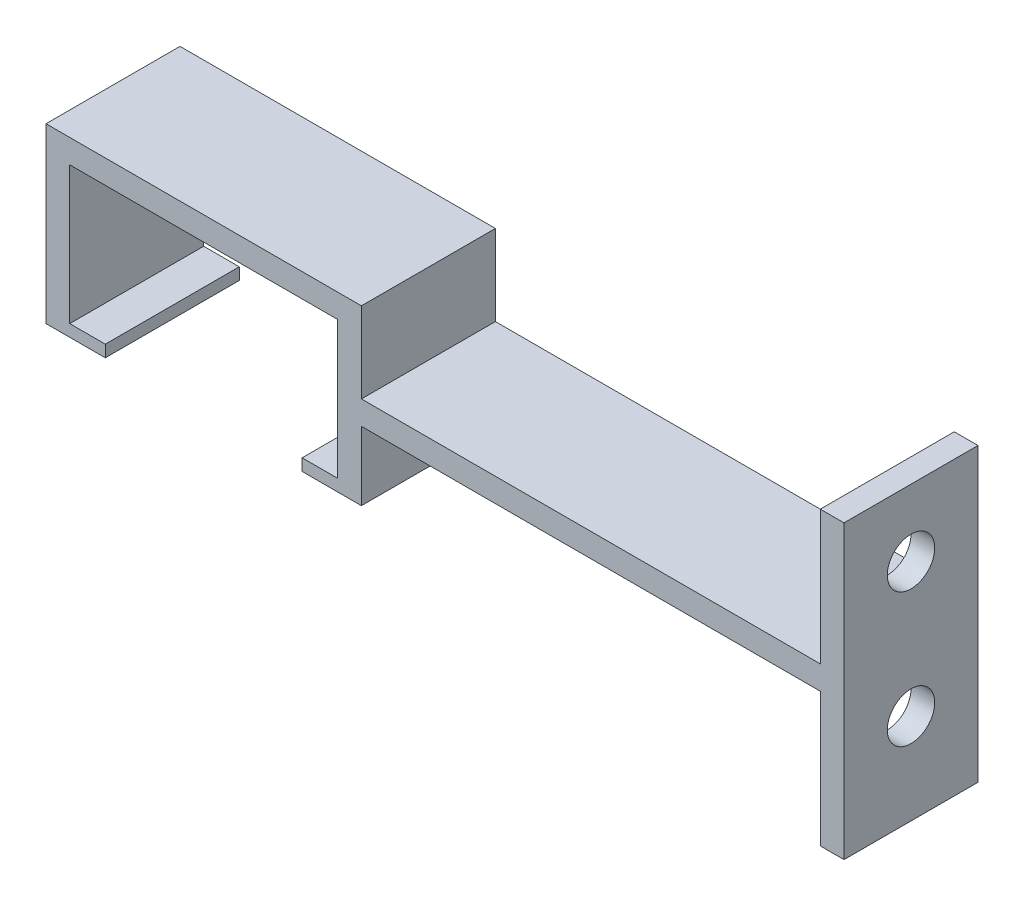
ISO-10303-21;
HEADER;
FILE_DESCRIPTION(('STEP AP214'),'2;1');
FILE_NAME('part.step','',(''),(''),'','','');
FILE_SCHEMA(('AUTOMOTIVE_DESIGN { 1 0 10303 214 1 1 1 1 }'));
ENDSEC;
DATA;
#1=APPLICATION_CONTEXT('core data for automotive mechanical design processes');
#2=APPLICATION_PROTOCOL_DEFINITION('international standard','automotive_design',2000,#1);
#3=PRODUCT_CONTEXT('',#1,'mechanical');
#4=PRODUCT('Part','Part','',(#3));
#5=PRODUCT_RELATED_PRODUCT_CATEGORY('part','',(#4));
#6=PRODUCT_DEFINITION_FORMATION('','',#4);
#7=PRODUCT_DEFINITION_CONTEXT('part definition',#1,'design');
#8=PRODUCT_DEFINITION('design','',#6,#7);
#9=PRODUCT_DEFINITION_SHAPE('','',#8);
#10=(LENGTH_UNIT() NAMED_UNIT(*) SI_UNIT(.MILLI.,.METRE.));
#11=(NAMED_UNIT(*) PLANE_ANGLE_UNIT() SI_UNIT($,.RADIAN.));
#12=(NAMED_UNIT(*) SI_UNIT($,.STERADIAN.) SOLID_ANGLE_UNIT());
#13=UNCERTAINTY_MEASURE_WITH_UNIT(LENGTH_MEASURE(1.E-05),#10,'distance_accuracy_value','');
#14=(GEOMETRIC_REPRESENTATION_CONTEXT(3) GLOBAL_UNCERTAINTY_ASSIGNED_CONTEXT((#13)) GLOBAL_UNIT_ASSIGNED_CONTEXT((#10,
#11,#12)) REPRESENTATION_CONTEXT('',''));
#15=CARTESIAN_POINT('',(0.,0.,0.));
#16=DIRECTION('',(0.,0.,1.));
#17=DIRECTION('',(1.,0.,0.));
#18=AXIS2_PLACEMENT_3D('',#15,#16,#17);
#19=CARTESIAN_POINT('',(0.,5.8,0.));
#20=DIRECTION('',(0.,1.,0.));
#21=DIRECTION('',(0.,0.,1.));
#22=AXIS2_PLACEMENT_3D('',#19,#20,#21);
#23=PLANE('',#22);
#24=DIRECTION('',(0.,0.,1.));
#25=VECTOR('',#24,1.);
#26=CARTESIAN_POINT('',(1.,5.8,11.3));
#27=LINE('',#26,#25);
#28=CARTESIAN_POINT('',(1.,5.8,0.));
#29=VERTEX_POINT('',#28);
#30=CARTESIAN_POINT('',(1.,5.8,11.3));
#31=VERTEX_POINT('',#30);
#32=EDGE_CURVE('E220',#29,#31,#27,.T.);
#33=ORIENTED_EDGE('',*,*,#32,.F.);
#34=DIRECTION('',(1.,0.,0.));
#35=VECTOR('',#34,1.);
#36=CARTESIAN_POINT('',(2.,5.8,0.));
#37=LINE('',#36,#35);
#38=CARTESIAN_POINT('',(39.7,5.8,0.));
#39=VERTEX_POINT('',#38);
#40=EDGE_CURVE('E307',#29,#39,#37,.T.);
#41=ORIENTED_EDGE('',*,*,#40,.T.);
#42=DIRECTION('',(0.,0.,-1.));
#43=VECTOR('',#42,1.);
#44=CARTESIAN_POINT('',(39.7,5.8,0.));
#45=LINE('',#44,#43);
#46=CARTESIAN_POINT('',(39.7,5.8,11.3));
#47=VERTEX_POINT('',#46);
#48=EDGE_CURVE('E273',#47,#39,#45,.T.);
#49=ORIENTED_EDGE('',*,*,#48,.F.);
#50=DIRECTION('',(-1.,0.,0.));
#51=VECTOR('',#50,1.);
#52=CARTESIAN_POINT('',(2.,5.8,11.3));
#53=LINE('',#52,#51);
#54=EDGE_CURVE('E67',#47,#31,#53,.T.);
#55=ORIENTED_EDGE('',*,*,#54,.T.);
#56=EDGE_LOOP('',(#33,#41,#49,#55));
#57=FACE_BOUND('',#56,.T.);
#58=ADVANCED_FACE('F41',(#57),#23,.F.);
#59=CARTESIAN_POINT('',(41.7,7.8,11.3));
#60=DIRECTION('',(0.,-1.,0.));
#61=DIRECTION('',(0.,0.,-1.));
#62=AXIS2_PLACEMENT_3D('',#59,#60,#61);
#63=PLANE('',#62);
#64=DIRECTION('',(0.,0.,1.));
#65=VECTOR('',#64,1.);
#66=CARTESIAN_POINT('',(39.7,7.8,11.3));
#67=LINE('',#66,#65);
#68=CARTESIAN_POINT('',(39.7,7.8,0.));
#69=VERTEX_POINT('',#68);
#70=CARTESIAN_POINT('',(39.7,7.8,11.3));
#71=VERTEX_POINT('',#70);
#72=EDGE_CURVE('E248',#69,#71,#67,.T.);
#73=ORIENTED_EDGE('',*,*,#72,.F.);
#74=DIRECTION('',(-1.,0.,0.));
#75=VECTOR('',#74,1.);
#76=CARTESIAN_POINT('',(41.7,7.8,0.));
#77=LINE('',#76,#75);
#78=CARTESIAN_POINT('',(1.,7.8,0.));
#79=VERTEX_POINT('',#78);
#80=EDGE_CURVE('E197',#69,#79,#77,.T.);
#81=ORIENTED_EDGE('',*,*,#80,.T.);
#82=DIRECTION('',(0.,0.,-1.));
#83=VECTOR('',#82,1.);
#84=CARTESIAN_POINT('',(1.,7.8,0.));
#85=LINE('',#84,#83);
#86=CARTESIAN_POINT('',(1.,7.8,11.3));
#87=VERTEX_POINT('',#86);
#88=EDGE_CURVE('E200',#87,#79,#85,.T.);
#89=ORIENTED_EDGE('',*,*,#88,.F.);
#90=DIRECTION('',(-1.,0.,0.));
#91=VECTOR('',#90,1.);
#92=CARTESIAN_POINT('',(41.7,7.8,11.3));
#93=LINE('',#92,#91);
#94=EDGE_CURVE('E185',#71,#87,#93,.T.);
#95=ORIENTED_EDGE('',*,*,#94,.F.);
#96=EDGE_LOOP('',(#73,#81,#89,#95));
#97=FACE_BOUND('',#96,.T.);
#98=ADVANCED_FACE('F201',(#97),#63,.F.);
#99=CARTESIAN_POINT('',(-20.6,0.,11.3));
#100=DIRECTION('',(0.,1.,0.));
#101=DIRECTION('',(-1.,0.,0.));
#102=AXIS2_PLACEMENT_3D('',#99,#100,#101);
#103=PLANE('',#102);
#104=DIRECTION('',(1.,0.,0.));
#105=VECTOR('',#104,1.);
#106=CARTESIAN_POINT('',(-20.6,0.,0.));
#107=LINE('',#106,#105);
#108=CARTESIAN_POINT('',(-25.6,0.,0.));
#109=VERTEX_POINT('',#108);
#110=CARTESIAN_POINT('',(-20.6,0.,0.));
#111=VERTEX_POINT('',#110);
#112=EDGE_CURVE('E316',#109,#111,#107,.T.);
#113=ORIENTED_EDGE('',*,*,#112,.T.);
#114=DIRECTION('',(0.,0.,-1.));
#115=VECTOR('',#114,1.);
#116=CARTESIAN_POINT('',(-20.6,0.,11.3));
#117=LINE('',#116,#115);
#118=CARTESIAN_POINT('',(-20.6,0.,11.3));
#119=VERTEX_POINT('',#118);
#120=EDGE_CURVE('E11',#119,#111,#117,.T.);
#121=ORIENTED_EDGE('',*,*,#120,.F.);
#122=DIRECTION('',(1.,0.,0.));
#123=VECTOR('',#122,1.);
#124=CARTESIAN_POINT('',(-20.6,0.,11.3));
#125=LINE('',#124,#123);
#126=CARTESIAN_POINT('',(-25.6,0.,11.3));
#127=VERTEX_POINT('',#126);
#128=EDGE_CURVE('E317',#127,#119,#125,.T.);
#129=ORIENTED_EDGE('',*,*,#128,.F.);
#130=DIRECTION('',(0.,0.,1.));
#131=VECTOR('',#130,1.);
#132=CARTESIAN_POINT('',(-25.6,0.,0.));
#133=LINE('',#132,#131);
#134=EDGE_CURVE('E244',#109,#127,#133,.T.);
#135=ORIENTED_EDGE('',*,*,#134,.F.);
#136=EDGE_LOOP('',(#113,#121,#129,#135));
#137=FACE_BOUND('',#136,.T.);
#138=ADVANCED_FACE('F43',(#137),#103,.F.);
#139=CARTESIAN_POINT('',(-20.6,0.999999999999997,11.3));
#140=DIRECTION('',(-1.,0.,0.));
#141=DIRECTION('',(0.,0.,1.));
#142=AXIS2_PLACEMENT_3D('',#139,#140,#141);
#143=PLANE('',#142);
#144=DIRECTION('',(0.,1.,0.));
#145=VECTOR('',#144,1.);
#146=CARTESIAN_POINT('',(-20.6,0.999999999999997,0.));
#147=LINE('',#146,#145);
#148=CARTESIAN_POINT('',(-20.6,0.999999999999997,0.));
#149=VERTEX_POINT('',#148);
#150=EDGE_CURVE('E348',#111,#149,#147,.T.);
#151=ORIENTED_EDGE('',*,*,#150,.T.);
#152=DIRECTION('',(0.,0.,-1.));
#153=VECTOR('',#152,1.);
#154=CARTESIAN_POINT('',(-20.6,0.999999999999997,11.3));
#155=LINE('',#154,#153);
#156=CARTESIAN_POINT('',(-20.6,0.999999999999997,11.3));
#157=VERTEX_POINT('',#156);
#158=EDGE_CURVE('E51',#157,#149,#155,.T.);
#159=ORIENTED_EDGE('',*,*,#158,.F.);
#160=DIRECTION('',(0.,1.,0.));
#161=VECTOR('',#160,1.);
#162=CARTESIAN_POINT('',(-20.6,0.999999999999997,11.3));
#163=LINE('',#162,#161);
#164=EDGE_CURVE('E320',#119,#157,#163,.T.);
#165=ORIENTED_EDGE('',*,*,#164,.F.);
#166=ORIENTED_EDGE('',*,*,#120,.T.);
#167=EDGE_LOOP('',(#151,#159,#165,#166));
#168=FACE_BOUND('',#167,.T.);
#169=ADVANCED_FACE('F451',(#168),#143,.F.);
#170=CARTESIAN_POINT('',(-23.6,0.999999999999997,11.3));
#171=DIRECTION('',(0.,-1.,0.));
#172=DIRECTION('',(1.,0.,0.));
#173=AXIS2_PLACEMENT_3D('',#170,#171,#172);
#174=PLANE('',#173);
#175=DIRECTION('',(-1.,0.,0.));
#176=VECTOR('',#175,1.);
#177=CARTESIAN_POINT('',(-23.6,0.999999999999997,0.));
#178=LINE('',#177,#176);
#179=CARTESIAN_POINT('',(-23.6,0.999999999999997,0.));
#180=VERTEX_POINT('',#179);
#181=EDGE_CURVE('E351',#149,#180,#178,.T.);
#182=ORIENTED_EDGE('',*,*,#181,.T.);
#183=DIRECTION('',(0.,0.,-1.));
#184=VECTOR('',#183,1.);
#185=CARTESIAN_POINT('',(-23.6,0.999999999999997,11.3));
#186=LINE('',#185,#184);
#187=CARTESIAN_POINT('',(-23.6,0.999999999999997,11.3));
#188=VERTEX_POINT('',#187);
#189=EDGE_CURVE('E390',#188,#180,#186,.T.);
#190=ORIENTED_EDGE('',*,*,#189,.F.);
#191=DIRECTION('',(-1.,0.,0.));
#192=VECTOR('',#191,1.);
#193=CARTESIAN_POINT('',(-23.6,0.999999999999997,11.3));
#194=LINE('',#193,#192);
#195=EDGE_CURVE('E324',#157,#188,#194,.T.);
#196=ORIENTED_EDGE('',*,*,#195,.F.);
#197=ORIENTED_EDGE('',*,*,#158,.T.);
#198=EDGE_LOOP('',(#182,#190,#196,#197));
#199=FACE_BOUND('',#198,.T.);
#200=ADVANCED_FACE('F456',(#199),#174,.F.);
#201=CARTESIAN_POINT('',(-23.6,12.6,11.3));
#202=DIRECTION('',(-1.,0.,0.));
#203=DIRECTION('',(0.,0.,1.));
#204=AXIS2_PLACEMENT_3D('',#201,#202,#203);
#205=PLANE('',#204);
#206=DIRECTION('',(0.,1.,0.));
#207=VECTOR('',#206,1.);
#208=CARTESIAN_POINT('',(-23.6,12.6,0.));
#209=LINE('',#208,#207);
#210=CARTESIAN_POINT('',(-23.6,12.6,0.));
#211=VERTEX_POINT('',#210);
#212=EDGE_CURVE('E354',#180,#211,#209,.T.);
#213=ORIENTED_EDGE('',*,*,#212,.T.);
#214=DIRECTION('',(0.,0.,-1.));
#215=VECTOR('',#214,1.);
#216=CARTESIAN_POINT('',(-23.6,12.6,11.3));
#217=LINE('',#216,#215);
#218=CARTESIAN_POINT('',(-23.6,12.6,11.3));
#219=VERTEX_POINT('',#218);
#220=EDGE_CURVE('E386',#219,#211,#217,.T.);
#221=ORIENTED_EDGE('',*,*,#220,.F.);
#222=DIRECTION('',(0.,1.,0.));
#223=VECTOR('',#222,1.);
#224=CARTESIAN_POINT('',(-23.6,12.6,11.3));
#225=LINE('',#224,#223);
#226=EDGE_CURVE('E327',#188,#219,#225,.T.);
#227=ORIENTED_EDGE('',*,*,#226,.F.);
#228=ORIENTED_EDGE('',*,*,#189,.T.);
#229=EDGE_LOOP('',(#213,#221,#227,#228));
#230=FACE_BOUND('',#229,.T.);
#231=ADVANCED_FACE('F462',(#230),#205,.F.);
#232=CARTESIAN_POINT('',(-23.6,12.6,11.3));
#233=DIRECTION('',(0.,1.,0.));
#234=DIRECTION('',(0.,0.,1.));
#235=AXIS2_PLACEMENT_3D('',#232,#233,#234);
#236=PLANE('',#235);
#237=DIRECTION('',(1.,0.,0.));
#238=VECTOR('',#237,1.);
#239=CARTESIAN_POINT('',(-23.6,12.6,0.));
#240=LINE('',#239,#238);
#241=CARTESIAN_POINT('',(-1.,12.6,0.));
#242=VERTEX_POINT('',#241);
#243=EDGE_CURVE('E357',#211,#242,#240,.T.);
#244=ORIENTED_EDGE('',*,*,#243,.T.);
#245=DIRECTION('',(0.,0.,-1.));
#246=VECTOR('',#245,1.);
#247=CARTESIAN_POINT('',(-1.,12.6,11.3));
#248=LINE('',#247,#246);
#249=CARTESIAN_POINT('',(-1.,12.6,11.3));
#250=VERTEX_POINT('',#249);
#251=EDGE_CURVE('E382',#250,#242,#248,.T.);
#252=ORIENTED_EDGE('',*,*,#251,.F.);
#253=DIRECTION('',(1.,0.,0.));
#254=VECTOR('',#253,1.);
#255=CARTESIAN_POINT('',(-23.6,12.6,11.3));
#256=LINE('',#255,#254);
#257=EDGE_CURVE('E330',#219,#250,#256,.T.);
#258=ORIENTED_EDGE('',*,*,#257,.F.);
#259=ORIENTED_EDGE('',*,*,#220,.T.);
#260=EDGE_LOOP('',(#244,#252,#258,#259));
#261=FACE_BOUND('',#260,.T.);
#262=ADVANCED_FACE('F466',(#261),#236,.F.);
#263=CARTESIAN_POINT('',(-1.,12.6,11.3));
#264=DIRECTION('',(1.,0.,0.));
#265=DIRECTION('',(0.,0.,-1.));
#266=AXIS2_PLACEMENT_3D('',#263,#264,#265);
#267=PLANE('',#266);
#268=DIRECTION('',(0.,-1.,0.));
#269=VECTOR('',#268,1.);
#270=CARTESIAN_POINT('',(-1.,12.6,0.));
#271=LINE('',#270,#269);
#272=CARTESIAN_POINT('',(-1.,0.999999999999997,0.));
#273=VERTEX_POINT('',#272);
#274=EDGE_CURVE('E360',#242,#273,#271,.T.);
#275=ORIENTED_EDGE('',*,*,#274,.T.);
#276=DIRECTION('',(0.,0.,-1.));
#277=VECTOR('',#276,1.);
#278=CARTESIAN_POINT('',(-1.,0.999999999999997,11.3));
#279=LINE('',#278,#277);
#280=CARTESIAN_POINT('',(-1.,0.999999999999997,11.3));
#281=VERTEX_POINT('',#280);
#282=EDGE_CURVE('E378',#281,#273,#279,.T.);
#283=ORIENTED_EDGE('',*,*,#282,.F.);
#284=DIRECTION('',(0.,-1.,0.));
#285=VECTOR('',#284,1.);
#286=CARTESIAN_POINT('',(-1.,12.6,11.3));
#287=LINE('',#286,#285);
#288=EDGE_CURVE('E333',#250,#281,#287,.T.);
#289=ORIENTED_EDGE('',*,*,#288,.F.);
#290=ORIENTED_EDGE('',*,*,#251,.T.);
#291=EDGE_LOOP('',(#275,#283,#289,#290));
#292=FACE_BOUND('',#291,.T.);
#293=ADVANCED_FACE('F471',(#292),#267,.F.);
#294=CARTESIAN_POINT('',(-4.,0.999999999999997,11.3));
#295=DIRECTION('',(0.,-1.,0.));
#296=DIRECTION('',(1.,0.,0.));
#297=AXIS2_PLACEMENT_3D('',#294,#295,#296);
#298=PLANE('',#297);
#299=DIRECTION('',(-1.,0.,0.));
#300=VECTOR('',#299,1.);
#301=CARTESIAN_POINT('',(-4.,0.999999999999997,0.));
#302=LINE('',#301,#300);
#303=CARTESIAN_POINT('',(-4.,0.999999999999997,0.));
#304=VERTEX_POINT('',#303);
#305=EDGE_CURVE('E363',#273,#304,#302,.T.);
#306=ORIENTED_EDGE('',*,*,#305,.T.);
#307=DIRECTION('',(0.,0.,-1.));
#308=VECTOR('',#307,1.);
#309=CARTESIAN_POINT('',(-4.,0.999999999999997,11.3));
#310=LINE('',#309,#308);
#311=CARTESIAN_POINT('',(-4.,0.999999999999997,11.3));
#312=VERTEX_POINT('',#311);
#313=EDGE_CURVE('E374',#312,#304,#310,.T.);
#314=ORIENTED_EDGE('',*,*,#313,.F.);
#315=DIRECTION('',(-1.,0.,0.));
#316=VECTOR('',#315,1.);
#317=CARTESIAN_POINT('',(-4.,0.999999999999997,11.3));
#318=LINE('',#317,#316);
#319=EDGE_CURVE('E336',#281,#312,#318,.T.);
#320=ORIENTED_EDGE('',*,*,#319,.F.);
#321=ORIENTED_EDGE('',*,*,#282,.T.);
#322=EDGE_LOOP('',(#306,#314,#320,#321));
#323=FACE_BOUND('',#322,.T.);
#324=ADVANCED_FACE('F477',(#323),#298,.F.);
#325=CARTESIAN_POINT('',(-4.,0.999999999999997,11.3));
#326=DIRECTION('',(1.,0.,0.));
#327=DIRECTION('',(0.,0.,-1.));
#328=AXIS2_PLACEMENT_3D('',#325,#326,#327);
#329=PLANE('',#328);
#330=DIRECTION('',(0.,-1.,0.));
#331=VECTOR('',#330,1.);
#332=CARTESIAN_POINT('',(-4.,0.999999999999997,0.));
#333=LINE('',#332,#331);
#334=CARTESIAN_POINT('',(-4.,0.,0.));
#335=VERTEX_POINT('',#334);
#336=EDGE_CURVE('E366',#304,#335,#333,.T.);
#337=ORIENTED_EDGE('',*,*,#336,.T.);
#338=DIRECTION('',(0.,0.,-1.));
#339=VECTOR('',#338,1.);
#340=CARTESIAN_POINT('',(-4.,0.,11.3));
#341=LINE('',#340,#339);
#342=CARTESIAN_POINT('',(-4.,0.,11.3));
#343=VERTEX_POINT('',#342);
#344=EDGE_CURVE('E345',#343,#335,#341,.T.);
#345=ORIENTED_EDGE('',*,*,#344,.F.);
#346=DIRECTION('',(0.,-1.,0.));
#347=VECTOR('',#346,1.);
#348=CARTESIAN_POINT('',(-4.,0.999999999999997,11.3));
#349=LINE('',#348,#347);
#350=EDGE_CURVE('E339',#312,#343,#349,.T.);
#351=ORIENTED_EDGE('',*,*,#350,.F.);
#352=ORIENTED_EDGE('',*,*,#313,.T.);
#353=EDGE_LOOP('',(#337,#345,#351,#352));
#354=FACE_BOUND('',#353,.T.);
#355=ADVANCED_FACE('F481',(#354),#329,.F.);
#356=CARTESIAN_POINT('',(0.,0.,11.3));
#357=DIRECTION('',(0.,1.,0.));
#358=DIRECTION('',(-1.,0.,0.));
#359=AXIS2_PLACEMENT_3D('',#356,#357,#358);
#360=PLANE('',#359);
#361=DIRECTION('',(1.,0.,0.));
#362=VECTOR('',#361,1.);
#363=CARTESIAN_POINT('',(0.,0.,0.));
#364=LINE('',#363,#362);
#365=CARTESIAN_POINT('',(1.,0.,0.));
#366=VERTEX_POINT('',#365);
#367=EDGE_CURVE('E321',#335,#366,#364,.T.);
#368=ORIENTED_EDGE('',*,*,#367,.T.);
#369=DIRECTION('',(0.,0.,1.));
#370=VECTOR('',#369,1.);
#371=CARTESIAN_POINT('',(1.,0.,11.3));
#372=LINE('',#371,#370);
#373=CARTESIAN_POINT('',(1.,0.,11.3));
#374=VERTEX_POINT('',#373);
#375=EDGE_CURVE('E221',#366,#374,#372,.T.);
#376=ORIENTED_EDGE('',*,*,#375,.T.);
#377=DIRECTION('',(1.,0.,0.));
#378=VECTOR('',#377,1.);
#379=CARTESIAN_POINT('',(0.,0.,11.3));
#380=LINE('',#379,#378);
#381=EDGE_CURVE('E342',#343,#374,#380,.T.);
#382=ORIENTED_EDGE('',*,*,#381,.F.);
#383=ORIENTED_EDGE('',*,*,#344,.T.);
#384=EDGE_LOOP('',(#368,#376,#382,#383));
#385=FACE_BOUND('',#384,.T.);
#386=ADVANCED_FACE('F485',(#385),#360,.F.);
#387=CARTESIAN_POINT('',(0.,0.,11.3));
#388=DIRECTION('',(0.,0.,1.));
#389=DIRECTION('',(1.,0.,0.));
#390=AXIS2_PLACEMENT_3D('',#387,#388,#389);
#391=PLANE('',#390);
#392=ORIENTED_EDGE('',*,*,#94,.T.);
#393=DIRECTION('',(0.,-1.,0.));
#394=VECTOR('',#393,1.);
#395=CARTESIAN_POINT('',(1.,7.8,11.3));
#396=LINE('',#395,#394);
#397=CARTESIAN_POINT('',(1.,14.6,11.3));
#398=VERTEX_POINT('',#397);
#399=EDGE_CURVE('E189',#398,#87,#396,.T.);
#400=ORIENTED_EDGE('',*,*,#399,.F.);
#401=DIRECTION('',(1.,0.,0.));
#402=VECTOR('',#401,1.);
#403=CARTESIAN_POINT('',(-16.6,14.6,11.3));
#404=LINE('',#403,#402);
#405=CARTESIAN_POINT('',(-25.6,14.6,11.3));
#406=VERTEX_POINT('',#405);
#407=EDGE_CURVE('E310',#406,#398,#404,.T.);
#408=ORIENTED_EDGE('',*,*,#407,.F.);
#409=DIRECTION('',(0.,-1.,0.));
#410=VECTOR('',#409,1.);
#411=CARTESIAN_POINT('',(-25.6,14.6,11.3));
#412=LINE('',#411,#410);
#413=EDGE_CURVE('E235',#406,#127,#412,.T.);
#414=ORIENTED_EDGE('',*,*,#413,.T.);
#415=ORIENTED_EDGE('',*,*,#128,.T.);
#416=ORIENTED_EDGE('',*,*,#164,.T.);
#417=ORIENTED_EDGE('',*,*,#195,.T.);
#418=ORIENTED_EDGE('',*,*,#226,.T.);
#419=ORIENTED_EDGE('',*,*,#257,.T.);
#420=ORIENTED_EDGE('',*,*,#288,.T.);
#421=ORIENTED_EDGE('',*,*,#319,.T.);
#422=ORIENTED_EDGE('',*,*,#350,.T.);
#423=ORIENTED_EDGE('',*,*,#381,.T.);
#424=DIRECTION('',(0.,1.,0.));
#425=VECTOR('',#424,1.);
#426=CARTESIAN_POINT('',(1.,0.,11.3));
#427=LINE('',#426,#425);
#428=EDGE_CURVE('E225',#374,#31,#427,.T.);
#429=ORIENTED_EDGE('',*,*,#428,.T.);
#430=ORIENTED_EDGE('',*,*,#54,.F.);
#431=DIRECTION('',(0.,1.,0.));
#432=VECTOR('',#431,1.);
#433=CARTESIAN_POINT('',(39.7,-5.5,11.3));
#434=LINE('',#433,#432);
#435=CARTESIAN_POINT('',(39.7,-5.5,11.3));
#436=VERTEX_POINT('',#435);
#437=EDGE_CURVE('E295',#436,#47,#434,.T.);
#438=ORIENTED_EDGE('',*,*,#437,.F.);
#439=DIRECTION('',(-1.,0.,0.));
#440=VECTOR('',#439,1.);
#441=CARTESIAN_POINT('',(41.7,-5.5,11.3));
#442=LINE('',#441,#440);
#443=CARTESIAN_POINT('',(41.7,-5.5,11.3));
#444=VERTEX_POINT('',#443);
#445=EDGE_CURVE('E278',#444,#436,#442,.T.);
#446=ORIENTED_EDGE('',*,*,#445,.F.);
#447=DIRECTION('',(0.,-1.,0.));
#448=VECTOR('',#447,1.);
#449=CARTESIAN_POINT('',(41.7,5.8,11.3));
#450=LINE('',#449,#448);
#451=CARTESIAN_POINT('',(41.7,19.1,11.3));
#452=VERTEX_POINT('',#451);
#453=EDGE_CURVE('E298',#452,#444,#450,.T.);
#454=ORIENTED_EDGE('',*,*,#453,.F.);
#455=DIRECTION('',(1.,0.,0.));
#456=VECTOR('',#455,1.);
#457=CARTESIAN_POINT('',(41.7,19.1,11.3));
#458=LINE('',#457,#456);
#459=CARTESIAN_POINT('',(39.7,19.1,11.3));
#460=VERTEX_POINT('',#459);
#461=EDGE_CURVE('E262',#460,#452,#458,.T.);
#462=ORIENTED_EDGE('',*,*,#461,.F.);
#463=DIRECTION('',(0.,-1.,0.));
#464=VECTOR('',#463,1.);
#465=CARTESIAN_POINT('',(39.7,19.1,11.3));
#466=LINE('',#465,#464);
#467=EDGE_CURVE('E193',#460,#71,#466,.T.);
#468=ORIENTED_EDGE('',*,*,#467,.T.);
#469=EDGE_LOOP('',(#392,#400,#408,#414,#415,#416,#417,#418,#419,#420,#421,#422,#423,#429,#430,
#438,#446,#454,#462,#468));
#470=FACE_BOUND('',#469,.T.);
#471=ADVANCED_FACE('F187',(#470),#391,.T.);
#472=CARTESIAN_POINT('',(0.,0.,0.));
#473=DIRECTION('',(0.,0.,1.));
#474=DIRECTION('',(1.,0.,0.));
#475=AXIS2_PLACEMENT_3D('',#472,#473,#474);
#476=PLANE('',#475);
#477=DIRECTION('',(0.,1.,0.));
#478=VECTOR('',#477,1.);
#479=CARTESIAN_POINT('',(1.,14.6,0.));
#480=LINE('',#479,#478);
#481=CARTESIAN_POINT('',(0.999999999999994,14.6,0.));
#482=VERTEX_POINT('',#481);
#483=EDGE_CURVE('E59',#79,#482,#480,.T.);
#484=ORIENTED_EDGE('',*,*,#483,.F.);
#485=ORIENTED_EDGE('',*,*,#80,.F.);
#486=DIRECTION('',(0.,-1.,0.));
#487=VECTOR('',#486,1.);
#488=CARTESIAN_POINT('',(39.7,19.1,0.));
#489=LINE('',#488,#487);
#490=CARTESIAN_POINT('',(39.7,19.1,0.));
#491=VERTEX_POINT('',#490);
#492=EDGE_CURVE('E270',#491,#69,#489,.T.);
#493=ORIENTED_EDGE('',*,*,#492,.F.);
#494=DIRECTION('',(-1.,0.,0.));
#495=VECTOR('',#494,1.);
#496=CARTESIAN_POINT('',(41.7,19.1,0.));
#497=LINE('',#496,#495);
#498=CARTESIAN_POINT('',(41.7,19.1,0.));
#499=VERTEX_POINT('',#498);
#500=EDGE_CURVE('E256',#499,#491,#497,.T.);
#501=ORIENTED_EDGE('',*,*,#500,.F.);
#502=DIRECTION('',(0.,1.,0.));
#503=VECTOR('',#502,1.);
#504=CARTESIAN_POINT('',(41.7,5.8,0.));
#505=LINE('',#504,#503);
#506=CARTESIAN_POINT('',(41.7,-5.5,0.));
#507=VERTEX_POINT('',#506);
#508=EDGE_CURVE('E198',#507,#499,#505,.T.);
#509=ORIENTED_EDGE('',*,*,#508,.F.);
#510=DIRECTION('',(1.,0.,0.));
#511=VECTOR('',#510,1.);
#512=CARTESIAN_POINT('',(41.7,-5.5,0.));
#513=LINE('',#512,#511);
#514=CARTESIAN_POINT('',(39.7,-5.5,0.));
#515=VERTEX_POINT('',#514);
#516=EDGE_CURVE('E284',#515,#507,#513,.T.);
#517=ORIENTED_EDGE('',*,*,#516,.F.);
#518=DIRECTION('',(0.,1.,0.));
#519=VECTOR('',#518,1.);
#520=CARTESIAN_POINT('',(39.7,-5.5,0.));
#521=LINE('',#520,#519);
#522=EDGE_CURVE('E288',#515,#39,#521,.T.);
#523=ORIENTED_EDGE('',*,*,#522,.T.);
#524=ORIENTED_EDGE('',*,*,#40,.F.);
#525=DIRECTION('',(0.,1.,0.));
#526=VECTOR('',#525,1.);
#527=CARTESIAN_POINT('',(1.,0.,0.));
#528=LINE('',#527,#526);
#529=EDGE_CURVE('E231',#366,#29,#528,.T.);
#530=ORIENTED_EDGE('',*,*,#529,.F.);
#531=ORIENTED_EDGE('',*,*,#367,.F.);
#532=ORIENTED_EDGE('',*,*,#336,.F.);
#533=ORIENTED_EDGE('',*,*,#305,.F.);
#534=ORIENTED_EDGE('',*,*,#274,.F.);
#535=ORIENTED_EDGE('',*,*,#243,.F.);
#536=ORIENTED_EDGE('',*,*,#212,.F.);
#537=ORIENTED_EDGE('',*,*,#181,.F.);
#538=ORIENTED_EDGE('',*,*,#150,.F.);
#539=ORIENTED_EDGE('',*,*,#112,.F.);
#540=DIRECTION('',(0.,-1.,0.));
#541=VECTOR('',#540,1.);
#542=CARTESIAN_POINT('',(-25.6,14.6,0.));
#543=LINE('',#542,#541);
#544=CARTESIAN_POINT('',(-25.6,14.6,0.));
#545=VERTEX_POINT('',#544);
#546=EDGE_CURVE('E236',#545,#109,#543,.T.);
#547=ORIENTED_EDGE('',*,*,#546,.F.);
#548=DIRECTION('',(-1.,0.,0.));
#549=VECTOR('',#548,1.);
#550=CARTESIAN_POINT('',(-16.6,14.6,0.));
#551=LINE('',#550,#549);
#552=EDGE_CURVE('E313',#482,#545,#551,.T.);
#553=ORIENTED_EDGE('',*,*,#552,.F.);
#554=EDGE_LOOP('',(#484,#485,#493,#501,#509,#517,#523,#524,#530,#531,#532,#533,#534,#535,#536,
#537,#538,#539,#547,#553));
#555=FACE_BOUND('',#554,.T.);
#556=ADVANCED_FACE('F429',(#555),#476,.F.);
#557=CARTESIAN_POINT('',(0.,14.6,0.));
#558=DIRECTION('',(0.,1.,0.));
#559=DIRECTION('',(-1.,0.,0.));
#560=AXIS2_PLACEMENT_3D('',#557,#558,#559);
#561=PLANE('',#560);
#562=DIRECTION('',(0.,0.,1.));
#563=VECTOR('',#562,1.);
#564=CARTESIAN_POINT('',(1.,14.6,11.3));
#565=LINE('',#564,#563);
#566=EDGE_CURVE('E206',#482,#398,#565,.T.);
#567=ORIENTED_EDGE('',*,*,#566,.F.);
#568=ORIENTED_EDGE('',*,*,#552,.T.);
#569=DIRECTION('',(0.,0.,1.));
#570=VECTOR('',#569,1.);
#571=CARTESIAN_POINT('',(-25.6,14.6,0.));
#572=LINE('',#571,#570);
#573=EDGE_CURVE('E240',#545,#406,#572,.T.);
#574=ORIENTED_EDGE('',*,*,#573,.T.);
#575=ORIENTED_EDGE('',*,*,#407,.T.);
#576=EDGE_LOOP('',(#567,#568,#574,#575));
#577=FACE_BOUND('',#576,.T.);
#578=ADVANCED_FACE('F416',(#577),#561,.T.);
#579=CARTESIAN_POINT('',(41.7,0.,0.));
#580=DIRECTION('',(-1.,0.,0.));
#581=DIRECTION('',(0.,0.,1.));
#582=AXIS2_PLACEMENT_3D('',#579,#580,#581);
#583=PLANE('',#582);
#584=CARTESIAN_POINT('',(41.7,13.45,5.64999999999999));
#585=DIRECTION('',(1.,0.,0.));
#586=DIRECTION('',(0.,0.,-1.));
#587=AXIS2_PLACEMENT_3D('',#584,#585,#586);
#588=CIRCLE('',#587,2.);
#589=CARTESIAN_POINT('',(41.7,13.45,3.64999999999999));
#590=VERTEX_POINT('',#589);
#591=EDGE_CURVE('E398',#590,#590,#588,.T.);
#592=ORIENTED_EDGE('',*,*,#591,.F.);
#593=EDGE_LOOP('',(#592));
#594=FACE_BOUND('',#593,.T.);
#595=CARTESIAN_POINT('',(41.7,2.15,5.64999999999999));
#596=DIRECTION('',(1.,0.,0.));
#597=DIRECTION('',(0.,0.,1.));
#598=AXIS2_PLACEMENT_3D('',#595,#596,#597);
#599=CIRCLE('',#598,2.);
#600=CARTESIAN_POINT('',(41.7,2.15,7.65));
#601=VERTEX_POINT('',#600);
#602=EDGE_CURVE('E213',#601,#601,#599,.T.);
#603=ORIENTED_EDGE('',*,*,#602,.F.);
#604=EDGE_LOOP('',(#603));
#605=FACE_BOUND('',#604,.T.);
#606=ORIENTED_EDGE('',*,*,#453,.T.);
#607=DIRECTION('',(0.,0.,1.));
#608=VECTOR('',#607,1.);
#609=CARTESIAN_POINT('',(41.7,-5.5,0.));
#610=LINE('',#609,#608);
#611=EDGE_CURVE('E274',#507,#444,#610,.T.);
#612=ORIENTED_EDGE('',*,*,#611,.F.);
#613=ORIENTED_EDGE('',*,*,#508,.T.);
#614=DIRECTION('',(0.,0.,-1.));
#615=VECTOR('',#614,1.);
#616=CARTESIAN_POINT('',(41.7,19.1,11.3));
#617=LINE('',#616,#615);
#618=EDGE_CURVE('E252',#452,#499,#617,.T.);
#619=ORIENTED_EDGE('',*,*,#618,.F.);
#620=EDGE_LOOP('',(#606,#612,#613,#619));
#621=FACE_BOUND('',#620,.T.);
#622=ADVANCED_FACE('F412',(#594,#605,#621),#583,.F.);
#623=CARTESIAN_POINT('',(39.7,-5.5,0.));
#624=DIRECTION('',(1.,0.,0.));
#625=DIRECTION('',(0.,0.,-1.));
#626=AXIS2_PLACEMENT_3D('',#623,#624,#625);
#627=PLANE('',#626);
#628=CARTESIAN_POINT('',(39.7,2.15,5.64999999999999));
#629=DIRECTION('',(1.,0.,0.));
#630=DIRECTION('',(0.,0.,-1.));
#631=AXIS2_PLACEMENT_3D('',#628,#629,#630);
#632=CIRCLE('',#631,2.);
#633=CARTESIAN_POINT('',(39.7,2.15,3.64999999999999));
#634=VERTEX_POINT('',#633);
#635=EDGE_CURVE('E45',#634,#634,#632,.T.);
#636=ORIENTED_EDGE('',*,*,#635,.T.);
#637=EDGE_LOOP('',(#636));
#638=FACE_BOUND('',#637,.T.);
#639=ORIENTED_EDGE('',*,*,#48,.T.);
#640=ORIENTED_EDGE('',*,*,#522,.F.);
#641=DIRECTION('',(0.,0.,-1.));
#642=VECTOR('',#641,1.);
#643=CARTESIAN_POINT('',(39.7,-5.5,0.));
#644=LINE('',#643,#642);
#645=EDGE_CURVE('E281',#436,#515,#644,.T.);
#646=ORIENTED_EDGE('',*,*,#645,.F.);
#647=ORIENTED_EDGE('',*,*,#437,.T.);
#648=EDGE_LOOP('',(#639,#640,#646,#647));
#649=FACE_BOUND('',#648,.T.);
#650=ADVANCED_FACE('F415',(#638,#649),#627,.F.);
#651=CARTESIAN_POINT('',(0.,-5.5,0.));
#652=DIRECTION('',(0.,-1.,0.));
#653=DIRECTION('',(0.,0.,-1.));
#654=AXIS2_PLACEMENT_3D('',#651,#652,#653);
#655=PLANE('',#654);
#656=ORIENTED_EDGE('',*,*,#611,.T.);
#657=ORIENTED_EDGE('',*,*,#445,.T.);
#658=ORIENTED_EDGE('',*,*,#645,.T.);
#659=ORIENTED_EDGE('',*,*,#516,.T.);
#660=EDGE_LOOP('',(#656,#657,#658,#659));
#661=FACE_BOUND('',#660,.T.);
#662=ADVANCED_FACE('F425',(#661),#655,.T.);
#663=CARTESIAN_POINT('',(39.7,19.1,11.3));
#664=DIRECTION('',(1.,0.,0.));
#665=DIRECTION('',(0.,0.,-1.));
#666=AXIS2_PLACEMENT_3D('',#663,#664,#665);
#667=PLANE('',#666);
#668=CARTESIAN_POINT('',(39.7,13.45,5.64999999999999));
#669=DIRECTION('',(1.,0.,0.));
#670=DIRECTION('',(0.,0.,-1.));
#671=AXIS2_PLACEMENT_3D('',#668,#669,#670);
#672=CIRCLE('',#671,2.);
#673=CARTESIAN_POINT('',(39.7,13.45,3.64999999999999));
#674=VERTEX_POINT('',#673);
#675=EDGE_CURVE('E211',#674,#674,#672,.T.);
#676=ORIENTED_EDGE('',*,*,#675,.T.);
#677=EDGE_LOOP('',(#676));
#678=FACE_BOUND('',#677,.T.);
#679=ORIENTED_EDGE('',*,*,#72,.T.);
#680=ORIENTED_EDGE('',*,*,#467,.F.);
#681=DIRECTION('',(0.,0.,1.));
#682=VECTOR('',#681,1.);
#683=CARTESIAN_POINT('',(39.7,19.1,11.3));
#684=LINE('',#683,#682);
#685=EDGE_CURVE('E259',#491,#460,#684,.T.);
#686=ORIENTED_EDGE('',*,*,#685,.F.);
#687=ORIENTED_EDGE('',*,*,#492,.T.);
#688=EDGE_LOOP('',(#679,#680,#686,#687));
#689=FACE_BOUND('',#688,.T.);
#690=ADVANCED_FACE('F436',(#678,#689),#667,.F.);
#691=CARTESIAN_POINT('',(0.,19.1,0.));
#692=DIRECTION('',(0.,1.,0.));
#693=DIRECTION('',(0.,0.,1.));
#694=AXIS2_PLACEMENT_3D('',#691,#692,#693);
#695=PLANE('',#694);
#696=ORIENTED_EDGE('',*,*,#618,.T.);
#697=ORIENTED_EDGE('',*,*,#500,.T.);
#698=ORIENTED_EDGE('',*,*,#685,.T.);
#699=ORIENTED_EDGE('',*,*,#461,.T.);
#700=EDGE_LOOP('',(#696,#697,#698,#699));
#701=FACE_BOUND('',#700,.T.);
#702=ADVANCED_FACE('F434',(#701),#695,.T.);
#703=CARTESIAN_POINT('',(-25.6,14.6,0.));
#704=DIRECTION('',(-1.,0.,0.));
#705=DIRECTION('',(0.,-1.,0.));
#706=AXIS2_PLACEMENT_3D('',#703,#704,#705);
#707=PLANE('',#706);
#708=ORIENTED_EDGE('',*,*,#413,.F.);
#709=ORIENTED_EDGE('',*,*,#573,.F.);
#710=ORIENTED_EDGE('',*,*,#546,.T.);
#711=ORIENTED_EDGE('',*,*,#134,.T.);
#712=EDGE_LOOP('',(#708,#709,#710,#711));
#713=FACE_BOUND('',#712,.T.);
#714=ADVANCED_FACE('F443',(#713),#707,.T.);
#715=CARTESIAN_POINT('',(1.,0.,11.3));
#716=DIRECTION('',(-1.,0.,0.));
#717=DIRECTION('',(0.,0.,1.));
#718=AXIS2_PLACEMENT_3D('',#715,#716,#717);
#719=PLANE('',#718);
#720=ORIENTED_EDGE('',*,*,#32,.T.);
#721=ORIENTED_EDGE('',*,*,#428,.F.);
#722=ORIENTED_EDGE('',*,*,#375,.F.);
#723=ORIENTED_EDGE('',*,*,#529,.T.);
#724=EDGE_LOOP('',(#720,#721,#722,#723));
#725=FACE_BOUND('',#724,.T.);
#726=ADVANCED_FACE('F489',(#725),#719,.F.);
#727=CARTESIAN_POINT('',(1.,0.,0.));
#728=DIRECTION('',(-1.,0.,0.));
#729=DIRECTION('',(0.,0.,1.));
#730=AXIS2_PLACEMENT_3D('',#727,#728,#729);
#731=PLANE('',#730);
#732=ORIENTED_EDGE('',*,*,#399,.T.);
#733=ORIENTED_EDGE('',*,*,#88,.T.);
#734=ORIENTED_EDGE('',*,*,#483,.T.);
#735=ORIENTED_EDGE('',*,*,#566,.T.);
#736=EDGE_LOOP('',(#732,#733,#734,#735));
#737=FACE_BOUND('',#736,.T.);
#738=ADVANCED_FACE('F205',(#737),#731,.F.);
#739=CARTESIAN_POINT('',(31.7000000000001,13.45,5.65));
#740=DIRECTION('',(1.,0.,0.));
#741=DIRECTION('',(0.,0.,-1.));
#742=AXIS2_PLACEMENT_3D('',#739,#740,#741);
#743=CYLINDRICAL_SURFACE('',#742,2.);
#744=ORIENTED_EDGE('',*,*,#591,.T.);
#745=EDGE_LOOP('',(#744));
#746=FACE_BOUND('',#745,.T.);
#747=ORIENTED_EDGE('',*,*,#675,.F.);
#748=EDGE_LOOP('',(#747));
#749=FACE_BOUND('',#748,.T.);
#750=ADVANCED_FACE('F575',(#746,#749),#743,.F.);
#751=CARTESIAN_POINT('',(31.7000000000001,2.15,5.65));
#752=DIRECTION('',(1.,0.,0.));
#753=DIRECTION('',(0.,0.,-1.));
#754=AXIS2_PLACEMENT_3D('',#751,#752,#753);
#755=CYLINDRICAL_SURFACE('',#754,2.);
#756=ORIENTED_EDGE('',*,*,#602,.T.);
#757=EDGE_LOOP('',(#756));
#758=FACE_BOUND('',#757,.T.);
#759=ORIENTED_EDGE('',*,*,#635,.F.);
#760=EDGE_LOOP('',(#759));
#761=FACE_BOUND('',#760,.T.);
#762=ADVANCED_FACE('F409',(#758,#761),#755,.F.);
#763=CLOSED_SHELL('',(#58,#98,#138,#169,#200,#231,#262,#293,#324,#355,#386,#471,#556,#578,#622,
#650,#662,#690,#702,#714,#726,#738,#750,#762));
#764=MANIFOLD_SOLID_BREP('B2',#763);
#765=ADVANCED_BREP_SHAPE_REPRESENTATION('',(#18,#764),#14);
#766=SHAPE_DEFINITION_REPRESENTATION(#9,#765);
ENDSEC;
END-ISO-10303-21;
